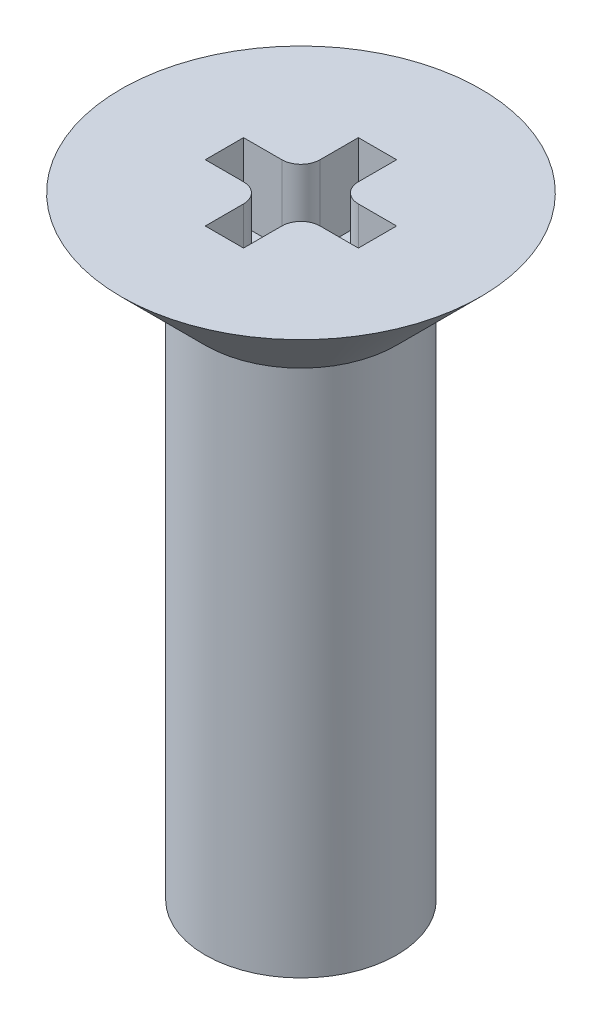
ISO-10303-21;
HEADER;
FILE_DESCRIPTION(('STEP AP214'),'2;1');
FILE_NAME('part.step','',(''),(''),'','','');
FILE_SCHEMA(('AUTOMOTIVE_DESIGN { 1 0 10303 214 1 1 1 1 }'));
ENDSEC;
DATA;
#1=APPLICATION_CONTEXT('core data for automotive mechanical design processes');
#2=APPLICATION_PROTOCOL_DEFINITION('international standard','automotive_design',2000,#1);
#3=PRODUCT_CONTEXT('',#1,'mechanical');
#4=PRODUCT('Part','Part','',(#3));
#5=PRODUCT_RELATED_PRODUCT_CATEGORY('part','',(#4));
#6=PRODUCT_DEFINITION_FORMATION('','',#4);
#7=PRODUCT_DEFINITION_CONTEXT('part definition',#1,'design');
#8=PRODUCT_DEFINITION('design','',#6,#7);
#9=PRODUCT_DEFINITION_SHAPE('','',#8);
#10=(LENGTH_UNIT() NAMED_UNIT(*) SI_UNIT(.MILLI.,.METRE.));
#11=(NAMED_UNIT(*) PLANE_ANGLE_UNIT() SI_UNIT($,.RADIAN.));
#12=(NAMED_UNIT(*) SI_UNIT($,.STERADIAN.) SOLID_ANGLE_UNIT());
#13=UNCERTAINTY_MEASURE_WITH_UNIT(LENGTH_MEASURE(1.E-05),#10,'distance_accuracy_value','');
#14=(GEOMETRIC_REPRESENTATION_CONTEXT(3) GLOBAL_UNCERTAINTY_ASSIGNED_CONTEXT((#13)) GLOBAL_UNIT_ASSIGNED_CONTEXT((#10,
#11,#12)) REPRESENTATION_CONTEXT('',''));
#15=CARTESIAN_POINT('',(0.,0.,0.));
#16=DIRECTION('',(0.,0.,1.));
#17=DIRECTION('',(1.,0.,0.));
#18=AXIS2_PLACEMENT_3D('',#15,#16,#17);
#19=CARTESIAN_POINT('',(0.,0.,0.));
#20=DIRECTION('',(0.,1.,0.));
#21=DIRECTION('',(0.,0.,1.));
#22=AXIS2_PLACEMENT_3D('',#19,#20,#21);
#23=PLANE('',#22);
#24=CARTESIAN_POINT('',(0.,0.,0.));
#25=DIRECTION('',(0.,1.,0.));
#26=DIRECTION('',(0.,0.,1.));
#27=AXIS2_PLACEMENT_3D('',#24,#25,#26);
#28=CIRCLE('',#27,2.35);
#29=CARTESIAN_POINT('',(0.,0.,2.35));
#30=VERTEX_POINT('',#29);
#31=EDGE_CURVE('E11',#30,#30,#28,.T.);
#32=ORIENTED_EDGE('',*,*,#31,.T.);
#33=EDGE_LOOP('',(#32));
#34=FACE_BOUND('',#33,.T.);
#35=DIRECTION('',(-1.,0.,0.));
#36=VECTOR('',#35,1.);
#37=CARTESIAN_POINT('',(0.5,0.,-0.25));
#38=LINE('',#37,#36);
#39=CARTESIAN_POINT('',(0.999999999999998,0.,-0.25));
#40=VERTEX_POINT('',#39);
#41=CARTESIAN_POINT('',(0.499999999999998,0.,-0.25));
#42=VERTEX_POINT('',#41);
#43=EDGE_CURVE('E48',#40,#42,#38,.T.);
#44=ORIENTED_EDGE('',*,*,#43,.F.);
#45=DIRECTION('',(0.,0.,-1.));
#46=VECTOR('',#45,1.);
#47=CARTESIAN_POINT('',(0.999999999999998,0.,0.25));
#48=LINE('',#47,#46);
#49=CARTESIAN_POINT('',(0.999999999999998,0.,0.25));
#50=VERTEX_POINT('',#49);
#51=EDGE_CURVE('E221',#50,#40,#48,.T.);
#52=ORIENTED_EDGE('',*,*,#51,.F.);
#53=DIRECTION('',(1.,0.,0.));
#54=VECTOR('',#53,1.);
#55=CARTESIAN_POINT('',(0.5,0.,0.25));
#56=LINE('',#55,#54);
#57=CARTESIAN_POINT('',(0.5,0.,0.25));
#58=VERTEX_POINT('',#57);
#59=EDGE_CURVE('E219',#58,#50,#56,.T.);
#60=ORIENTED_EDGE('',*,*,#59,.F.);
#61=CARTESIAN_POINT('',(0.499999999999998,0.,0.5));
#62=DIRECTION('',(0.,-1.,0.));
#63=DIRECTION('',(0.,0.,1.));
#64=AXIS2_PLACEMENT_3D('',#61,#62,#63);
#65=CIRCLE('',#64,0.25);
#66=CARTESIAN_POINT('',(0.249999999999998,0.,0.500000000000002));
#67=VERTEX_POINT('',#66);
#68=EDGE_CURVE('E156',#67,#58,#65,.T.);
#69=ORIENTED_EDGE('',*,*,#68,.F.);
#70=DIRECTION('',(0.,0.,-1.));
#71=VECTOR('',#70,1.);
#72=CARTESIAN_POINT('',(0.249999999999998,0.,1.));
#73=LINE('',#72,#71);
#74=CARTESIAN_POINT('',(0.249999999999998,0.,1.));
#75=VERTEX_POINT('',#74);
#76=EDGE_CURVE('E215',#75,#67,#73,.T.);
#77=ORIENTED_EDGE('',*,*,#76,.F.);
#78=DIRECTION('',(1.,0.,0.));
#79=VECTOR('',#78,1.);
#80=CARTESIAN_POINT('',(-0.250000000000002,0.,1.));
#81=LINE('',#80,#79);
#82=CARTESIAN_POINT('',(-0.250000000000002,0.,1.));
#83=VERTEX_POINT('',#82);
#84=EDGE_CURVE('E212',#83,#75,#81,.T.);
#85=ORIENTED_EDGE('',*,*,#84,.F.);
#86=DIRECTION('',(0.,0.,1.));
#87=VECTOR('',#86,1.);
#88=CARTESIAN_POINT('',(-0.250000000000002,0.,1.));
#89=LINE('',#88,#87);
#90=CARTESIAN_POINT('',(-0.250000000000002,0.,0.500000000000002));
#91=VERTEX_POINT('',#90);
#92=EDGE_CURVE('E209',#91,#83,#89,.T.);
#93=ORIENTED_EDGE('',*,*,#92,.F.);
#94=CARTESIAN_POINT('',(-0.500000000000002,0.,0.5));
#95=DIRECTION('',(0.,-1.,0.));
#96=DIRECTION('',(0.,0.,1.));
#97=AXIS2_PLACEMENT_3D('',#94,#95,#96);
#98=CIRCLE('',#97,0.25);
#99=CARTESIAN_POINT('',(-0.500000000000003,0.,0.25));
#100=VERTEX_POINT('',#99);
#101=EDGE_CURVE('E206',#100,#91,#98,.T.);
#102=ORIENTED_EDGE('',*,*,#101,.F.);
#103=DIRECTION('',(1.,0.,0.));
#104=VECTOR('',#103,1.);
#105=CARTESIAN_POINT('',(-1.,0.,0.25));
#106=LINE('',#105,#104);
#107=CARTESIAN_POINT('',(-1.,0.,0.25));
#108=VERTEX_POINT('',#107);
#109=EDGE_CURVE('E203',#108,#100,#106,.T.);
#110=ORIENTED_EDGE('',*,*,#109,.F.);
#111=DIRECTION('',(0.,0.,1.));
#112=VECTOR('',#111,1.);
#113=CARTESIAN_POINT('',(-1.,0.,0.25));
#114=LINE('',#113,#112);
#115=CARTESIAN_POINT('',(-1.,0.,-0.25));
#116=VERTEX_POINT('',#115);
#117=EDGE_CURVE('E200',#116,#108,#114,.T.);
#118=ORIENTED_EDGE('',*,*,#117,.F.);
#119=DIRECTION('',(-1.,0.,0.));
#120=VECTOR('',#119,1.);
#121=CARTESIAN_POINT('',(-1.,0.,-0.25));
#122=LINE('',#121,#120);
#123=CARTESIAN_POINT('',(-0.500000000000003,0.,-0.25));
#124=VERTEX_POINT('',#123);
#125=EDGE_CURVE('E197',#124,#116,#122,.T.);
#126=ORIENTED_EDGE('',*,*,#125,.F.);
#127=CARTESIAN_POINT('',(-0.500000000000002,0.,-0.5));
#128=DIRECTION('',(0.,-1.,0.));
#129=DIRECTION('',(0.,0.,1.));
#130=AXIS2_PLACEMENT_3D('',#127,#128,#129);
#131=CIRCLE('',#130,0.25);
#132=CARTESIAN_POINT('',(-0.250000000000002,0.,-0.500000000000001));
#133=VERTEX_POINT('',#132);
#134=EDGE_CURVE('E194',#133,#124,#131,.T.);
#135=ORIENTED_EDGE('',*,*,#134,.F.);
#136=DIRECTION('',(0.,0.,1.));
#137=VECTOR('',#136,1.);
#138=CARTESIAN_POINT('',(-0.250000000000002,0.,-0.500000000000002));
#139=LINE('',#138,#137);
#140=CARTESIAN_POINT('',(-0.250000000000002,0.,-1.));
#141=VERTEX_POINT('',#140);
#142=EDGE_CURVE('E191',#141,#133,#139,.T.);
#143=ORIENTED_EDGE('',*,*,#142,.F.);
#144=DIRECTION('',(-1.,0.,0.));
#145=VECTOR('',#144,1.);
#146=CARTESIAN_POINT('',(-0.250000000000002,0.,-1.));
#147=LINE('',#146,#145);
#148=CARTESIAN_POINT('',(0.249999999999998,0.,-1.));
#149=VERTEX_POINT('',#148);
#150=EDGE_CURVE('E188',#149,#141,#147,.T.);
#151=ORIENTED_EDGE('',*,*,#150,.F.);
#152=DIRECTION('',(0.,0.,-1.));
#153=VECTOR('',#152,1.);
#154=CARTESIAN_POINT('',(0.249999999999998,0.,-0.500000000000002));
#155=LINE('',#154,#153);
#156=CARTESIAN_POINT('',(0.249999999999998,0.,-0.500000000000002));
#157=VERTEX_POINT('',#156);
#158=EDGE_CURVE('E185',#157,#149,#155,.T.);
#159=ORIENTED_EDGE('',*,*,#158,.F.);
#160=CARTESIAN_POINT('',(0.499999999999998,0.,-0.5));
#161=DIRECTION('',(0.,-1.,0.));
#162=DIRECTION('',(0.,0.,1.));
#163=AXIS2_PLACEMENT_3D('',#160,#161,#162);
#164=CIRCLE('',#163,0.25);
#165=EDGE_CURVE('E182',#42,#157,#164,.T.);
#166=ORIENTED_EDGE('',*,*,#165,.F.);
#167=EDGE_LOOP('',(#44,#52,#60,#69,#77,#85,#93,#102,#110,#118,#126,#135,#143,#151,#159,#166));
#168=FACE_BOUND('',#167,.T.);
#169=ADVANCED_FACE('F34',(#34,#168),#23,.T.);
#170=CARTESIAN_POINT('',(0.,0.,0.));
#171=DIRECTION('',(0.,1.,0.));
#172=DIRECTION('',(0.,0.,1.));
#173=AXIS2_PLACEMENT_3D('',#170,#171,#172);
#174=CONICAL_SURFACE('',#173,2.35,0.785398163397447);
#175=CARTESIAN_POINT('',(0.,-1.1,0.));
#176=DIRECTION('',(0.,1.,0.));
#177=DIRECTION('',(0.,0.,1.));
#178=AXIS2_PLACEMENT_3D('',#175,#176,#177);
#179=CIRCLE('',#178,1.25);
#180=CARTESIAN_POINT('',(0.,-1.1,1.25));
#181=VERTEX_POINT('',#180);
#182=EDGE_CURVE('E41',#181,#181,#179,.T.);
#183=ORIENTED_EDGE('',*,*,#182,.T.);
#184=EDGE_LOOP('',(#183));
#185=FACE_BOUND('',#184,.T.);
#186=ORIENTED_EDGE('',*,*,#31,.F.);
#187=EDGE_LOOP('',(#186));
#188=FACE_BOUND('',#187,.T.);
#189=ADVANCED_FACE('F255',(#185,#188),#174,.T.);
#190=CARTESIAN_POINT('',(0.,0.872326938896606,0.));
#191=DIRECTION('',(0.,1.,0.));
#192=DIRECTION('',(0.,0.,1.));
#193=AXIS2_PLACEMENT_3D('',#190,#191,#192);
#194=CYLINDRICAL_SURFACE('',#193,1.25);
#195=ORIENTED_EDGE('',*,*,#182,.F.);
#196=EDGE_LOOP('',(#195));
#197=FACE_BOUND('',#196,.T.);
#198=CARTESIAN_POINT('',(0.,-8.,0.));
#199=DIRECTION('',(0.,-1.,0.));
#200=DIRECTION('',(0.,0.,-1.));
#201=AXIS2_PLACEMENT_3D('',#198,#199,#200);
#202=CIRCLE('',#201,1.25);
#203=CARTESIAN_POINT('',(0.,-8.,-1.25));
#204=VERTEX_POINT('',#203);
#205=EDGE_CURVE('E225',#204,#204,#202,.T.);
#206=ORIENTED_EDGE('',*,*,#205,.F.);
#207=EDGE_LOOP('',(#206));
#208=FACE_BOUND('',#207,.T.);
#209=ADVANCED_FACE('F258',(#197,#208),#194,.T.);
#210=CARTESIAN_POINT('',(0.,-8.,0.));
#211=DIRECTION('',(0.,-1.,0.));
#212=DIRECTION('',(0.,0.,-1.));
#213=AXIS2_PLACEMENT_3D('',#210,#211,#212);
#214=PLANE('',#213);
#215=ORIENTED_EDGE('',*,*,#205,.T.);
#216=EDGE_LOOP('',(#215));
#217=FACE_BOUND('',#216,.T.);
#218=ADVANCED_FACE('F261',(#217),#214,.T.);
#219=CARTESIAN_POINT('',(0.5,-1.,-0.25));
#220=DIRECTION('',(0.,0.,-1.));
#221=DIRECTION('',(-1.,0.,0.));
#222=AXIS2_PLACEMENT_3D('',#219,#220,#221);
#223=PLANE('',#222);
#224=ORIENTED_EDGE('',*,*,#43,.T.);
#225=DIRECTION('',(0.,1.,0.));
#226=VECTOR('',#225,1.);
#227=CARTESIAN_POINT('',(0.499999999999998,-1.,-0.25));
#228=LINE('',#227,#226);
#229=CARTESIAN_POINT('',(0.499999999999998,-1.,-0.25));
#230=VERTEX_POINT('',#229);
#231=EDGE_CURVE('E108',#230,#42,#228,.T.);
#232=ORIENTED_EDGE('',*,*,#231,.F.);
#233=DIRECTION('',(-1.,0.,0.));
#234=VECTOR('',#233,1.);
#235=CARTESIAN_POINT('',(0.5,-1.,-0.25));
#236=LINE('',#235,#234);
#237=CARTESIAN_POINT('',(0.999999999999998,-1.,-0.25));
#238=VERTEX_POINT('',#237);
#239=EDGE_CURVE('E223',#238,#230,#236,.T.);
#240=ORIENTED_EDGE('',*,*,#239,.F.);
#241=DIRECTION('',(0.,1.,0.));
#242=VECTOR('',#241,1.);
#243=CARTESIAN_POINT('',(0.999999999999998,-1.,-0.25));
#244=LINE('',#243,#242);
#245=EDGE_CURVE('E56',#238,#40,#244,.T.);
#246=ORIENTED_EDGE('',*,*,#245,.T.);
#247=EDGE_LOOP('',(#224,#232,#240,#246));
#248=FACE_BOUND('',#247,.T.);
#249=ADVANCED_FACE('F266',(#248),#223,.F.);
#250=CARTESIAN_POINT('',(0.999999999999998,-1.,0.25));
#251=DIRECTION('',(1.,0.,0.));
#252=DIRECTION('',(0.,0.,-1.));
#253=AXIS2_PLACEMENT_3D('',#250,#251,#252);
#254=PLANE('',#253);
#255=ORIENTED_EDGE('',*,*,#51,.T.);
#256=ORIENTED_EDGE('',*,*,#245,.F.);
#257=DIRECTION('',(0.,0.,-1.));
#258=VECTOR('',#257,1.);
#259=CARTESIAN_POINT('',(0.999999999999998,-1.,0.25));
#260=LINE('',#259,#258);
#261=CARTESIAN_POINT('',(0.999999999999998,-1.,0.25));
#262=VERTEX_POINT('',#261);
#263=EDGE_CURVE('E168',#262,#238,#260,.T.);
#264=ORIENTED_EDGE('',*,*,#263,.F.);
#265=DIRECTION('',(0.,1.,0.));
#266=VECTOR('',#265,1.);
#267=CARTESIAN_POINT('',(0.999999999999998,-1.,0.25));
#268=LINE('',#267,#266);
#269=EDGE_CURVE('E160',#262,#50,#268,.T.);
#270=ORIENTED_EDGE('',*,*,#269,.T.);
#271=EDGE_LOOP('',(#255,#256,#264,#270));
#272=FACE_BOUND('',#271,.T.);
#273=ADVANCED_FACE('F271',(#272),#254,.F.);
#274=CARTESIAN_POINT('',(0.5,-1.,0.25));
#275=DIRECTION('',(0.,0.,1.));
#276=DIRECTION('',(1.,0.,0.));
#277=AXIS2_PLACEMENT_3D('',#274,#275,#276);
#278=PLANE('',#277);
#279=ORIENTED_EDGE('',*,*,#59,.T.);
#280=ORIENTED_EDGE('',*,*,#269,.F.);
#281=DIRECTION('',(1.,0.,0.));
#282=VECTOR('',#281,1.);
#283=CARTESIAN_POINT('',(0.5,-1.,0.25));
#284=LINE('',#283,#282);
#285=CARTESIAN_POINT('',(0.5,-1.,0.25));
#286=VERTEX_POINT('',#285);
#287=EDGE_CURVE('E164',#286,#262,#284,.T.);
#288=ORIENTED_EDGE('',*,*,#287,.F.);
#289=DIRECTION('',(0.,1.,0.));
#290=VECTOR('',#289,1.);
#291=CARTESIAN_POINT('',(0.5,-1.,0.25));
#292=LINE('',#291,#290);
#293=EDGE_CURVE('E149',#286,#58,#292,.T.);
#294=ORIENTED_EDGE('',*,*,#293,.T.);
#295=EDGE_LOOP('',(#279,#280,#288,#294));
#296=FACE_BOUND('',#295,.T.);
#297=ADVANCED_FACE('F165',(#296),#278,.F.);
#298=CARTESIAN_POINT('',(0.499999999999998,-1.,0.5));
#299=DIRECTION('',(0.,1.,0.));
#300=DIRECTION('',(0.,0.,1.));
#301=AXIS2_PLACEMENT_3D('',#298,#299,#300);
#302=CYLINDRICAL_SURFACE('',#301,0.25);
#303=ORIENTED_EDGE('',*,*,#68,.T.);
#304=ORIENTED_EDGE('',*,*,#293,.F.);
#305=CARTESIAN_POINT('',(0.499999999999998,-1.,0.5));
#306=DIRECTION('',(0.,-1.,0.));
#307=DIRECTION('',(0.,0.,1.));
#308=AXIS2_PLACEMENT_3D('',#305,#306,#307);
#309=CIRCLE('',#308,0.25);
#310=CARTESIAN_POINT('',(0.249999999999998,-1.,0.500000000000002));
#311=VERTEX_POINT('',#310);
#312=EDGE_CURVE('E153',#311,#286,#309,.T.);
#313=ORIENTED_EDGE('',*,*,#312,.F.);
#314=DIRECTION('',(0.,1.,0.));
#315=VECTOR('',#314,1.);
#316=CARTESIAN_POINT('',(0.249999999999998,-1.,0.500000000000002));
#317=LINE('',#316,#315);
#318=EDGE_CURVE('E161',#311,#67,#317,.T.);
#319=ORIENTED_EDGE('',*,*,#318,.T.);
#320=EDGE_LOOP('',(#303,#304,#313,#319));
#321=FACE_BOUND('',#320,.T.);
#322=ADVANCED_FACE('F151',(#321),#302,.T.);
#323=CARTESIAN_POINT('',(0.249999999999998,-1.,1.));
#324=DIRECTION('',(1.,0.,0.));
#325=DIRECTION('',(0.,0.,-1.));
#326=AXIS2_PLACEMENT_3D('',#323,#324,#325);
#327=PLANE('',#326);
#328=ORIENTED_EDGE('',*,*,#76,.T.);
#329=ORIENTED_EDGE('',*,*,#318,.F.);
#330=DIRECTION('',(0.,0.,-1.));
#331=VECTOR('',#330,1.);
#332=CARTESIAN_POINT('',(0.249999999999998,-1.,1.));
#333=LINE('',#332,#331);
#334=CARTESIAN_POINT('',(0.249999999999998,-1.,1.));
#335=VERTEX_POINT('',#334);
#336=EDGE_CURVE('E174',#335,#311,#333,.T.);
#337=ORIENTED_EDGE('',*,*,#336,.F.);
#338=DIRECTION('',(0.,1.,0.));
#339=VECTOR('',#338,1.);
#340=CARTESIAN_POINT('',(0.249999999999998,-1.,1.));
#341=LINE('',#340,#339);
#342=EDGE_CURVE('E228',#335,#75,#341,.T.);
#343=ORIENTED_EDGE('',*,*,#342,.T.);
#344=EDGE_LOOP('',(#328,#329,#337,#343));
#345=FACE_BOUND('',#344,.T.);
#346=ADVANCED_FACE('F325',(#345),#327,.F.);
#347=CARTESIAN_POINT('',(-0.250000000000002,-1.,1.));
#348=DIRECTION('',(0.,0.,1.));
#349=DIRECTION('',(1.,0.,0.));
#350=AXIS2_PLACEMENT_3D('',#347,#348,#349);
#351=PLANE('',#350);
#352=ORIENTED_EDGE('',*,*,#84,.T.);
#353=ORIENTED_EDGE('',*,*,#342,.F.);
#354=DIRECTION('',(1.,0.,0.));
#355=VECTOR('',#354,1.);
#356=CARTESIAN_POINT('',(-0.250000000000002,-1.,1.));
#357=LINE('',#356,#355);
#358=CARTESIAN_POINT('',(-0.250000000000002,-1.,1.));
#359=VERTEX_POINT('',#358);
#360=EDGE_CURVE('E176',#359,#335,#357,.T.);
#361=ORIENTED_EDGE('',*,*,#360,.F.);
#362=DIRECTION('',(0.,1.,0.));
#363=VECTOR('',#362,1.);
#364=CARTESIAN_POINT('',(-0.250000000000002,-1.,1.));
#365=LINE('',#364,#363);
#366=EDGE_CURVE('E230',#359,#83,#365,.T.);
#367=ORIENTED_EDGE('',*,*,#366,.T.);
#368=EDGE_LOOP('',(#352,#353,#361,#367));
#369=FACE_BOUND('',#368,.T.);
#370=ADVANCED_FACE('F321',(#369),#351,.F.);
#371=CARTESIAN_POINT('',(-0.250000000000002,-1.,1.));
#372=DIRECTION('',(-1.,0.,0.));
#373=DIRECTION('',(0.,0.,1.));
#374=AXIS2_PLACEMENT_3D('',#371,#372,#373);
#375=PLANE('',#374);
#376=ORIENTED_EDGE('',*,*,#92,.T.);
#377=ORIENTED_EDGE('',*,*,#366,.F.);
#378=DIRECTION('',(0.,0.,1.));
#379=VECTOR('',#378,1.);
#380=CARTESIAN_POINT('',(-0.250000000000002,-1.,1.));
#381=LINE('',#380,#379);
#382=CARTESIAN_POINT('',(-0.250000000000002,-1.,0.500000000000002));
#383=VERTEX_POINT('',#382);
#384=EDGE_CURVE('E316',#383,#359,#381,.T.);
#385=ORIENTED_EDGE('',*,*,#384,.F.);
#386=DIRECTION('',(0.,1.,0.));
#387=VECTOR('',#386,1.);
#388=CARTESIAN_POINT('',(-0.250000000000002,-1.,0.500000000000002));
#389=LINE('',#388,#387);
#390=EDGE_CURVE('E232',#383,#91,#389,.T.);
#391=ORIENTED_EDGE('',*,*,#390,.T.);
#392=EDGE_LOOP('',(#376,#377,#385,#391));
#393=FACE_BOUND('',#392,.T.);
#394=ADVANCED_FACE('F330',(#393),#375,.F.);
#395=CARTESIAN_POINT('',(-0.500000000000002,-1.,0.5));
#396=DIRECTION('',(0.,1.,0.));
#397=DIRECTION('',(0.,0.,1.));
#398=AXIS2_PLACEMENT_3D('',#395,#396,#397);
#399=CYLINDRICAL_SURFACE('',#398,0.25);
#400=ORIENTED_EDGE('',*,*,#101,.T.);
#401=ORIENTED_EDGE('',*,*,#390,.F.);
#402=CARTESIAN_POINT('',(-0.500000000000002,-1.,0.5));
#403=DIRECTION('',(0.,-1.,0.));
#404=DIRECTION('',(0.,0.,1.));
#405=AXIS2_PLACEMENT_3D('',#402,#403,#404);
#406=CIRCLE('',#405,0.25);
#407=CARTESIAN_POINT('',(-0.500000000000003,-1.,0.25));
#408=VERTEX_POINT('',#407);
#409=EDGE_CURVE('E313',#408,#383,#406,.T.);
#410=ORIENTED_EDGE('',*,*,#409,.F.);
#411=DIRECTION('',(0.,1.,0.));
#412=VECTOR('',#411,1.);
#413=CARTESIAN_POINT('',(-0.500000000000003,-1.,0.25));
#414=LINE('',#413,#412);
#415=EDGE_CURVE('E234',#408,#100,#414,.T.);
#416=ORIENTED_EDGE('',*,*,#415,.T.);
#417=EDGE_LOOP('',(#400,#401,#410,#416));
#418=FACE_BOUND('',#417,.T.);
#419=ADVANCED_FACE('F333',(#418),#399,.T.);
#420=CARTESIAN_POINT('',(-1.,-1.,0.25));
#421=DIRECTION('',(0.,0.,1.));
#422=DIRECTION('',(1.,0.,0.));
#423=AXIS2_PLACEMENT_3D('',#420,#421,#422);
#424=PLANE('',#423);
#425=ORIENTED_EDGE('',*,*,#109,.T.);
#426=ORIENTED_EDGE('',*,*,#415,.F.);
#427=DIRECTION('',(1.,0.,0.));
#428=VECTOR('',#427,1.);
#429=CARTESIAN_POINT('',(-1.,-1.,0.25));
#430=LINE('',#429,#428);
#431=CARTESIAN_POINT('',(-1.,-1.,0.25));
#432=VERTEX_POINT('',#431);
#433=EDGE_CURVE('E310',#432,#408,#430,.T.);
#434=ORIENTED_EDGE('',*,*,#433,.F.);
#435=DIRECTION('',(0.,1.,0.));
#436=VECTOR('',#435,1.);
#437=CARTESIAN_POINT('',(-1.,-1.,0.25));
#438=LINE('',#437,#436);
#439=EDGE_CURVE('E236',#432,#108,#438,.T.);
#440=ORIENTED_EDGE('',*,*,#439,.T.);
#441=EDGE_LOOP('',(#425,#426,#434,#440));
#442=FACE_BOUND('',#441,.T.);
#443=ADVANCED_FACE('F336',(#442),#424,.F.);
#444=CARTESIAN_POINT('',(-1.,-1.,0.25));
#445=DIRECTION('',(-1.,0.,0.));
#446=DIRECTION('',(0.,0.,1.));
#447=AXIS2_PLACEMENT_3D('',#444,#445,#446);
#448=PLANE('',#447);
#449=ORIENTED_EDGE('',*,*,#117,.T.);
#450=ORIENTED_EDGE('',*,*,#439,.F.);
#451=DIRECTION('',(0.,0.,1.));
#452=VECTOR('',#451,1.);
#453=CARTESIAN_POINT('',(-1.,-1.,0.25));
#454=LINE('',#453,#452);
#455=CARTESIAN_POINT('',(-1.,-1.,-0.25));
#456=VERTEX_POINT('',#455);
#457=EDGE_CURVE('E307',#456,#432,#454,.T.);
#458=ORIENTED_EDGE('',*,*,#457,.F.);
#459=DIRECTION('',(0.,1.,0.));
#460=VECTOR('',#459,1.);
#461=CARTESIAN_POINT('',(-1.,-1.,-0.25));
#462=LINE('',#461,#460);
#463=EDGE_CURVE('E238',#456,#116,#462,.T.);
#464=ORIENTED_EDGE('',*,*,#463,.T.);
#465=EDGE_LOOP('',(#449,#450,#458,#464));
#466=FACE_BOUND('',#465,.T.);
#467=ADVANCED_FACE('F341',(#466),#448,.F.);
#468=CARTESIAN_POINT('',(-1.,-1.,-0.25));
#469=DIRECTION('',(0.,0.,-1.));
#470=DIRECTION('',(-1.,0.,0.));
#471=AXIS2_PLACEMENT_3D('',#468,#469,#470);
#472=PLANE('',#471);
#473=ORIENTED_EDGE('',*,*,#125,.T.);
#474=ORIENTED_EDGE('',*,*,#463,.F.);
#475=DIRECTION('',(-1.,0.,0.));
#476=VECTOR('',#475,1.);
#477=CARTESIAN_POINT('',(-1.,-1.,-0.25));
#478=LINE('',#477,#476);
#479=CARTESIAN_POINT('',(-0.500000000000003,-1.,-0.25));
#480=VERTEX_POINT('',#479);
#481=EDGE_CURVE('E304',#480,#456,#478,.T.);
#482=ORIENTED_EDGE('',*,*,#481,.F.);
#483=DIRECTION('',(0.,1.,0.));
#484=VECTOR('',#483,1.);
#485=CARTESIAN_POINT('',(-0.500000000000003,-1.,-0.25));
#486=LINE('',#485,#484);
#487=EDGE_CURVE('E240',#480,#124,#486,.T.);
#488=ORIENTED_EDGE('',*,*,#487,.T.);
#489=EDGE_LOOP('',(#473,#474,#482,#488));
#490=FACE_BOUND('',#489,.T.);
#491=ADVANCED_FACE('F345',(#490),#472,.F.);
#492=CARTESIAN_POINT('',(-0.500000000000002,-1.,-0.5));
#493=DIRECTION('',(0.,1.,0.));
#494=DIRECTION('',(0.,0.,1.));
#495=AXIS2_PLACEMENT_3D('',#492,#493,#494);
#496=CYLINDRICAL_SURFACE('',#495,0.25);
#497=ORIENTED_EDGE('',*,*,#134,.T.);
#498=ORIENTED_EDGE('',*,*,#487,.F.);
#499=CARTESIAN_POINT('',(-0.500000000000002,-1.,-0.5));
#500=DIRECTION('',(0.,-1.,0.));
#501=DIRECTION('',(0.,0.,1.));
#502=AXIS2_PLACEMENT_3D('',#499,#500,#501);
#503=CIRCLE('',#502,0.25);
#504=CARTESIAN_POINT('',(-0.250000000000002,-1.,-0.500000000000001));
#505=VERTEX_POINT('',#504);
#506=EDGE_CURVE('E301',#505,#480,#503,.T.);
#507=ORIENTED_EDGE('',*,*,#506,.F.);
#508=DIRECTION('',(0.,1.,0.));
#509=VECTOR('',#508,1.);
#510=CARTESIAN_POINT('',(-0.250000000000002,-1.,-0.500000000000001));
#511=LINE('',#510,#509);
#512=EDGE_CURVE('E242',#505,#133,#511,.T.);
#513=ORIENTED_EDGE('',*,*,#512,.T.);
#514=EDGE_LOOP('',(#497,#498,#507,#513));
#515=FACE_BOUND('',#514,.T.);
#516=ADVANCED_FACE('F348',(#515),#496,.T.);
#517=CARTESIAN_POINT('',(-0.250000000000002,-1.,-0.500000000000002));
#518=DIRECTION('',(-1.,0.,0.));
#519=DIRECTION('',(0.,0.,1.));
#520=AXIS2_PLACEMENT_3D('',#517,#518,#519);
#521=PLANE('',#520);
#522=ORIENTED_EDGE('',*,*,#142,.T.);
#523=ORIENTED_EDGE('',*,*,#512,.F.);
#524=DIRECTION('',(0.,0.,1.));
#525=VECTOR('',#524,1.);
#526=CARTESIAN_POINT('',(-0.250000000000002,-1.,-0.500000000000002));
#527=LINE('',#526,#525);
#528=CARTESIAN_POINT('',(-0.250000000000002,-1.,-1.));
#529=VERTEX_POINT('',#528);
#530=EDGE_CURVE('E298',#529,#505,#527,.T.);
#531=ORIENTED_EDGE('',*,*,#530,.F.);
#532=DIRECTION('',(0.,1.,0.));
#533=VECTOR('',#532,1.);
#534=CARTESIAN_POINT('',(-0.250000000000002,-1.,-1.));
#535=LINE('',#534,#533);
#536=EDGE_CURVE('E244',#529,#141,#535,.T.);
#537=ORIENTED_EDGE('',*,*,#536,.T.);
#538=EDGE_LOOP('',(#522,#523,#531,#537));
#539=FACE_BOUND('',#538,.T.);
#540=ADVANCED_FACE('F351',(#539),#521,.F.);
#541=CARTESIAN_POINT('',(-0.250000000000002,-1.,-1.));
#542=DIRECTION('',(0.,0.,-1.));
#543=DIRECTION('',(-1.,0.,0.));
#544=AXIS2_PLACEMENT_3D('',#541,#542,#543);
#545=PLANE('',#544);
#546=ORIENTED_EDGE('',*,*,#150,.T.);
#547=ORIENTED_EDGE('',*,*,#536,.F.);
#548=DIRECTION('',(-1.,0.,0.));
#549=VECTOR('',#548,1.);
#550=CARTESIAN_POINT('',(-0.250000000000002,-1.,-1.));
#551=LINE('',#550,#549);
#552=CARTESIAN_POINT('',(0.249999999999998,-1.,-1.));
#553=VERTEX_POINT('',#552);
#554=EDGE_CURVE('E295',#553,#529,#551,.T.);
#555=ORIENTED_EDGE('',*,*,#554,.F.);
#556=DIRECTION('',(0.,1.,0.));
#557=VECTOR('',#556,1.);
#558=CARTESIAN_POINT('',(0.249999999999998,-1.,-1.));
#559=LINE('',#558,#557);
#560=EDGE_CURVE('E246',#553,#149,#559,.T.);
#561=ORIENTED_EDGE('',*,*,#560,.T.);
#562=EDGE_LOOP('',(#546,#547,#555,#561));
#563=FACE_BOUND('',#562,.T.);
#564=ADVANCED_FACE('F355',(#563),#545,.F.);
#565=CARTESIAN_POINT('',(0.249999999999998,-1.,-0.500000000000002));
#566=DIRECTION('',(1.,0.,0.));
#567=DIRECTION('',(0.,0.,-1.));
#568=AXIS2_PLACEMENT_3D('',#565,#566,#567);
#569=PLANE('',#568);
#570=ORIENTED_EDGE('',*,*,#158,.T.);
#571=ORIENTED_EDGE('',*,*,#560,.F.);
#572=DIRECTION('',(0.,0.,-1.));
#573=VECTOR('',#572,1.);
#574=CARTESIAN_POINT('',(0.249999999999998,-1.,-0.500000000000002));
#575=LINE('',#574,#573);
#576=CARTESIAN_POINT('',(0.249999999999998,-1.,-0.500000000000002));
#577=VERTEX_POINT('',#576);
#578=EDGE_CURVE('E290',#577,#553,#575,.T.);
#579=ORIENTED_EDGE('',*,*,#578,.F.);
#580=DIRECTION('',(0.,1.,0.));
#581=VECTOR('',#580,1.);
#582=CARTESIAN_POINT('',(0.249999999999998,-1.,-0.500000000000002));
#583=LINE('',#582,#581);
#584=EDGE_CURVE('E248',#577,#157,#583,.T.);
#585=ORIENTED_EDGE('',*,*,#584,.T.);
#586=EDGE_LOOP('',(#570,#571,#579,#585));
#587=FACE_BOUND('',#586,.T.);
#588=ADVANCED_FACE('F357',(#587),#569,.F.);
#589=CARTESIAN_POINT('',(0.499999999999998,-1.,-0.5));
#590=DIRECTION('',(0.,1.,0.));
#591=DIRECTION('',(0.,0.,1.));
#592=AXIS2_PLACEMENT_3D('',#589,#590,#591);
#593=CYLINDRICAL_SURFACE('',#592,0.25);
#594=ORIENTED_EDGE('',*,*,#165,.T.);
#595=ORIENTED_EDGE('',*,*,#584,.F.);
#596=CARTESIAN_POINT('',(0.499999999999998,-1.,-0.5));
#597=DIRECTION('',(0.,-1.,0.));
#598=DIRECTION('',(0.,0.,1.));
#599=AXIS2_PLACEMENT_3D('',#596,#597,#598);
#600=CIRCLE('',#599,0.25);
#601=EDGE_CURVE('E288',#230,#577,#600,.T.);
#602=ORIENTED_EDGE('',*,*,#601,.F.);
#603=ORIENTED_EDGE('',*,*,#231,.T.);
#604=EDGE_LOOP('',(#594,#595,#602,#603));
#605=FACE_BOUND('',#604,.T.);
#606=ADVANCED_FACE('F285',(#605),#593,.T.);
#607=CARTESIAN_POINT('',(0.499999999999998,-1.,0.5));
#608=DIRECTION('',(0.,1.,0.));
#609=DIRECTION('',(0.,0.,1.));
#610=AXIS2_PLACEMENT_3D('',#607,#608,#609);
#611=PLANE('',#610);
#612=ORIENTED_EDGE('',*,*,#239,.T.);
#613=ORIENTED_EDGE('',*,*,#601,.T.);
#614=ORIENTED_EDGE('',*,*,#578,.T.);
#615=ORIENTED_EDGE('',*,*,#554,.T.);
#616=ORIENTED_EDGE('',*,*,#530,.T.);
#617=ORIENTED_EDGE('',*,*,#506,.T.);
#618=ORIENTED_EDGE('',*,*,#481,.T.);
#619=ORIENTED_EDGE('',*,*,#457,.T.);
#620=ORIENTED_EDGE('',*,*,#433,.T.);
#621=ORIENTED_EDGE('',*,*,#409,.T.);
#622=ORIENTED_EDGE('',*,*,#384,.T.);
#623=ORIENTED_EDGE('',*,*,#360,.T.);
#624=ORIENTED_EDGE('',*,*,#336,.T.);
#625=ORIENTED_EDGE('',*,*,#312,.T.);
#626=ORIENTED_EDGE('',*,*,#287,.T.);
#627=ORIENTED_EDGE('',*,*,#263,.T.);
#628=EDGE_LOOP('',(#612,#613,#614,#615,#616,#617,#618,#619,#620,#621,#622,#623,#624,#625,#626,#627));
#629=FACE_BOUND('',#628,.T.);
#630=ADVANCED_FACE('F171',(#629),#611,.T.);
#631=CLOSED_SHELL('',(#169,#189,#209,#218,#249,#273,#297,#322,#346,#370,#394,#419,#443,#467,
#491,#516,#540,#564,#588,#606,#630));
#632=MANIFOLD_SOLID_BREP('B2',#631);
#633=ADVANCED_BREP_SHAPE_REPRESENTATION('',(#18,#632),#14);
#634=SHAPE_DEFINITION_REPRESENTATION(#9,#633);
ENDSEC;
END-ISO-10303-21;
